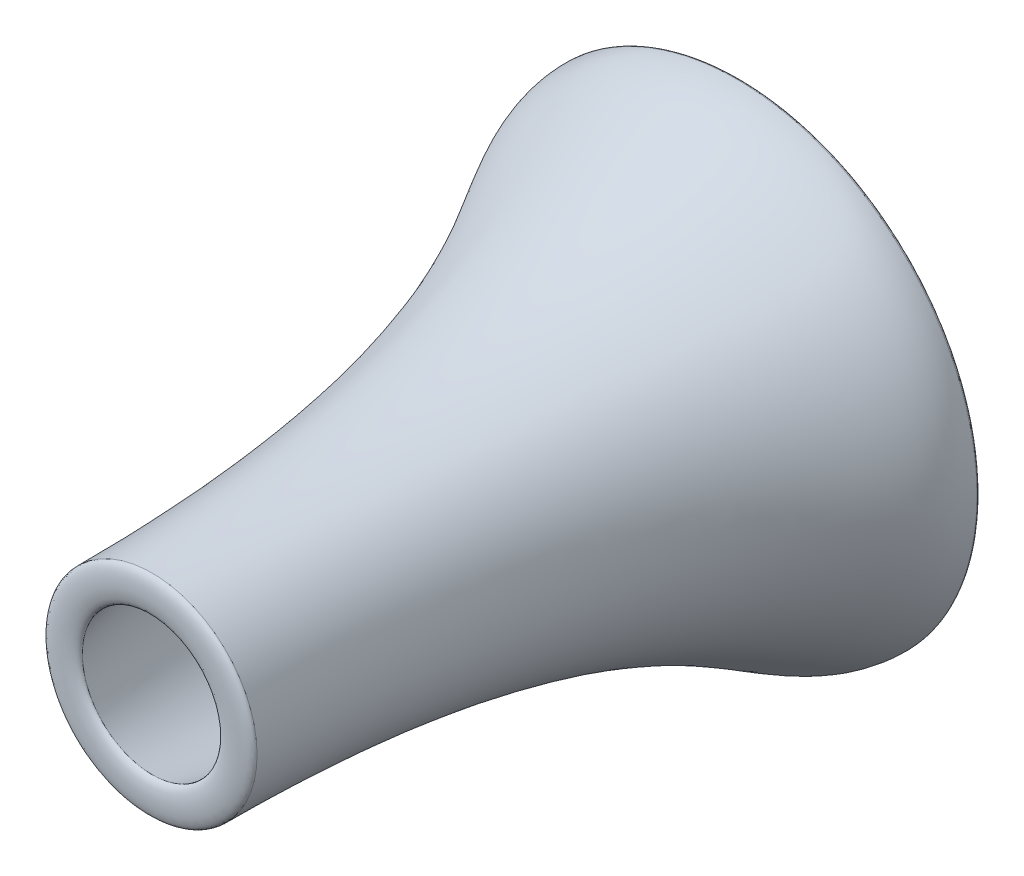
ISO-10303-21;
HEADER;
FILE_DESCRIPTION(('STEP AP214'),'2;1');
FILE_NAME('part.step','',(''),(''),'','','');
FILE_SCHEMA(('AUTOMOTIVE_DESIGN { 1 0 10303 214 1 1 1 1 }'));
ENDSEC;
DATA;
#1=APPLICATION_CONTEXT('core data for automotive mechanical design processes');
#2=APPLICATION_PROTOCOL_DEFINITION('international standard','automotive_design',2000,#1);
#3=PRODUCT_CONTEXT('',#1,'mechanical');
#4=PRODUCT('Part','Part','',(#3));
#5=PRODUCT_RELATED_PRODUCT_CATEGORY('part','',(#4));
#6=PRODUCT_DEFINITION_FORMATION('','',#4);
#7=PRODUCT_DEFINITION_CONTEXT('part definition',#1,'design');
#8=PRODUCT_DEFINITION('design','',#6,#7);
#9=PRODUCT_DEFINITION_SHAPE('','',#8);
#10=(LENGTH_UNIT() NAMED_UNIT(*) SI_UNIT(.MILLI.,.METRE.));
#11=(NAMED_UNIT(*) PLANE_ANGLE_UNIT() SI_UNIT($,.RADIAN.));
#12=(NAMED_UNIT(*) SI_UNIT($,.STERADIAN.) SOLID_ANGLE_UNIT());
#13=UNCERTAINTY_MEASURE_WITH_UNIT(LENGTH_MEASURE(1.E-05),#10,'distance_accuracy_value','');
#14=(GEOMETRIC_REPRESENTATION_CONTEXT(3) GLOBAL_UNCERTAINTY_ASSIGNED_CONTEXT((#13)) GLOBAL_UNIT_ASSIGNED_CONTEXT((#10,
#11,#12)) REPRESENTATION_CONTEXT('',''));
#15=CARTESIAN_POINT('',(0.,0.,0.));
#16=DIRECTION('',(0.,0.,1.));
#17=DIRECTION('',(1.,0.,0.));
#18=AXIS2_PLACEMENT_3D('',#15,#16,#17);
#19=CARTESIAN_POINT('',(-166.463971853403,0.,1094.65467806476));
#20=CARTESIAN_POINT('',(-166.463971853403,0.,1107.35467806476));
#21=CARTESIAN_POINT('',(-110.643738413778,0.,1107.35467806476));
#22=CARTESIAN_POINT('',(-110.643738413778,0.,1094.65467806476));
#23=B_SPLINE_CURVE_WITH_KNOTS('',3,(#19,#20,#21,#22),.UNSPECIFIED.,.F.,.F.,(4,4),(0.,1.),.UNSPECIFIED.);
#24=CARTESIAN_POINT('',(0.,0.,1104.75683012291));
#25=DIRECTION('',(0.,0.,1.));
#26=AXIS1_PLACEMENT('',#24,#25);
#27=SURFACE_OF_REVOLUTION('',#23,#26);
#28=CARTESIAN_POINT('',(0.,0.,1094.65467806476));
#29=DIRECTION('',(0.,0.,1.));
#30=DIRECTION('',(1.,0.,0.));
#31=AXIS2_PLACEMENT_3D('',#28,#29,#30);
#32=CIRCLE('',#31,110.643738413778);
#33=CARTESIAN_POINT('',(110.643738413778,0.,1094.65467806476));
#34=VERTEX_POINT('',#33);
#35=EDGE_CURVE('E47',#34,#34,#32,.T.);
#36=ORIENTED_EDGE('',*,*,#35,.F.);
#37=EDGE_LOOP('',(#36));
#38=FACE_BOUND('',#37,.T.);
#39=CARTESIAN_POINT('',(0.,0.,1094.65467806476));
#40=DIRECTION('',(0.,0.,1.));
#41=DIRECTION('',(1.,0.,0.));
#42=AXIS2_PLACEMENT_3D('',#39,#40,#41);
#43=CIRCLE('',#42,166.463971853403);
#44=CARTESIAN_POINT('',(166.463971853403,0.,1094.65467806476));
#45=VERTEX_POINT('',#44);
#46=EDGE_CURVE('E11',#45,#45,#43,.T.);
#47=ORIENTED_EDGE('',*,*,#46,.T.);
#48=EDGE_LOOP('',(#47));
#49=FACE_BOUND('',#48,.T.);
#50=ADVANCED_FACE('F40',(#38,#49),#27,.T.);
#51=CARTESIAN_POINT('',(-166.463971853403,0.,1094.65467806476));
#52=DIRECTION('',(0.,0.,1.));
#53=DIRECTION('',(1.,0.,0.));
#54=AXIS2_PLACEMENT_3D('',#51,#52,#53);
#55=PLANE('',#54);
#56=ORIENTED_EDGE('',*,*,#46,.F.);
#57=EDGE_LOOP('',(#56));
#58=FACE_BOUND('',#57,.T.);
#59=ORIENTED_EDGE('',*,*,#35,.T.);
#60=EDGE_LOOP('',(#59));
#61=FACE_BOUND('',#60,.T.);
#62=ADVANCED_FACE('F59',(#58,#61),#55,.F.);
#63=CLOSED_SHELL('',(#50,#62));
#64=MANIFOLD_SOLID_BREP('B2',#63);
#65=CARTESIAN_POINT('',(-259.495458194181,0.,167.561077713543));
#66=CARTESIAN_POINT('',(-259.495458194181,0.,150.62774438021));
#67=CARTESIAN_POINT('',(-381.249942517428,0.,150.62774438021));
#68=CARTESIAN_POINT('',(-381.249942517428,0.,167.561077713543));
#69=B_SPLINE_CURVE_WITH_KNOTS('',3,(#65,#66,#67,#68),.UNSPECIFIED.,.F.,.F.,(4,4),(0.,1.),.UNSPECIFIED.);
#70=CARTESIAN_POINT('',(0.,0.,99.6847843209707));
#71=DIRECTION('',(0.,0.,1.));
#72=AXIS1_PLACEMENT('',#70,#71);
#73=SURFACE_OF_REVOLUTION('',#69,#72);
#74=CARTESIAN_POINT('',(0.,0.,167.561077713543));
#75=DIRECTION('',(0.,0.,1.));
#76=DIRECTION('',(1.,0.,0.));
#77=AXIS2_PLACEMENT_3D('',#74,#75,#76);
#78=CIRCLE('',#77,381.249942517428);
#79=CARTESIAN_POINT('',(381.249942517428,0.,167.561077713543));
#80=VERTEX_POINT('',#79);
#81=EDGE_CURVE('E39',#80,#80,#78,.T.);
#82=ORIENTED_EDGE('',*,*,#81,.F.);
#83=EDGE_LOOP('',(#82));
#84=FACE_BOUND('',#83,.T.);
#85=CARTESIAN_POINT('',(0.,0.,167.561077713543));
#86=DIRECTION('',(0.,0.,1.));
#87=DIRECTION('',(1.,0.,0.));
#88=AXIS2_PLACEMENT_3D('',#85,#86,#87);
#89=CIRCLE('',#88,259.495458194181);
#90=CARTESIAN_POINT('',(259.495458194181,0.,167.561077713543));
#91=VERTEX_POINT('',#90);
#92=EDGE_CURVE('E93',#91,#91,#89,.T.);
#93=ORIENTED_EDGE('',*,*,#92,.T.);
#94=EDGE_LOOP('',(#93));
#95=FACE_BOUND('',#94,.T.);
#96=ADVANCED_FACE('F86',(#84,#95),#73,.T.);
#97=CARTESIAN_POINT('',(-381.249942517428,0.,167.561077713543));
#98=DIRECTION('',(0.,0.,-1.));
#99=DIRECTION('',(-1.,0.,0.));
#100=AXIS2_PLACEMENT_3D('',#97,#98,#99);
#101=PLANE('',#100);
#102=ORIENTED_EDGE('',*,*,#92,.F.);
#103=EDGE_LOOP('',(#102));
#104=FACE_BOUND('',#103,.T.);
#105=ORIENTED_EDGE('',*,*,#81,.T.);
#106=EDGE_LOOP('',(#105));
#107=FACE_BOUND('',#106,.T.);
#108=ADVANCED_FACE('F106',(#104,#107),#101,.F.);
#109=CLOSED_SHELL('',(#96,#108));
#110=MANIFOLD_SOLID_BREP('B6',#109);
#111=CARTESIAN_POINT('',(-110.643738413778,0.,1094.65467806476));
#112=CARTESIAN_POINT('',(-183.485035369402,0.,717.331180746709));
#113=CARTESIAN_POINT('',(-128.674034213742,0.,903.320051910767));
#114=CARTESIAN_POINT('',(-243.481208411908,0.,195.194577557418));
#115=CARTESIAN_POINT('',(-259.495458194181,0.,167.561077713543));
#116=B_SPLINE_CURVE_WITH_KNOTS('',3,(#111,#112,#113,#114,#115),.UNSPECIFIED.,.F.,.F.,(4,1,4),
(0.,0.793493092504956,1.),.UNSPECIFIED.);
#117=CARTESIAN_POINT('',(0.,0.,99.6847843209707));
#118=DIRECTION('',(0.,0.,1.));
#119=AXIS1_PLACEMENT('',#117,#118);
#120=SURFACE_OF_REVOLUTION('',#116,#119);
#121=CARTESIAN_POINT('',(0.,0.,167.561077713543));
#122=DIRECTION('',(0.,0.,1.));
#123=DIRECTION('',(1.,0.,0.));
#124=AXIS2_PLACEMENT_3D('',#121,#122,#123);
#125=CIRCLE('',#124,259.495458194181);
#126=CARTESIAN_POINT('',(259.495458194181,0.,167.561077713543));
#127=VERTEX_POINT('',#126);
#128=EDGE_CURVE('E85',#127,#127,#125,.T.);
#129=ORIENTED_EDGE('',*,*,#128,.F.);
#130=EDGE_LOOP('',(#129));
#131=FACE_BOUND('',#130,.T.);
#132=CARTESIAN_POINT('',(0.,0.,1094.65467806476));
#133=DIRECTION('',(0.,0.,1.));
#134=DIRECTION('',(1.,0.,0.));
#135=AXIS2_PLACEMENT_3D('',#132,#133,#134);
#136=CIRCLE('',#135,110.643738413778);
#137=CARTESIAN_POINT('',(110.643738413778,0.,1094.65467806476));
#138=VERTEX_POINT('',#137);
#139=EDGE_CURVE('E140',#138,#138,#136,.T.);
#140=ORIENTED_EDGE('',*,*,#139,.T.);
#141=EDGE_LOOP('',(#140));
#142=FACE_BOUND('',#141,.T.);
#143=ADVANCED_FACE('F125',(#131,#142),#120,.T.);
#144=CARTESIAN_POINT('',(-259.495458194181,0.,167.561077713543));
#145=DIRECTION('',(0.,0.,1.));
#146=DIRECTION('',(1.,0.,0.));
#147=AXIS2_PLACEMENT_3D('',#144,#145,#146);
#148=PLANE('',#147);
#149=CARTESIAN_POINT('',(0.,0.,167.561077713543));
#150=DIRECTION('',(0.,0.,1.));
#151=DIRECTION('',(1.,0.,0.));
#152=AXIS2_PLACEMENT_3D('',#149,#150,#151);
#153=CIRCLE('',#152,381.249942517428);
#154=CARTESIAN_POINT('',(381.249942517428,0.,167.561077713543));
#155=VERTEX_POINT('',#154);
#156=EDGE_CURVE('E132',#155,#155,#153,.T.);
#157=ORIENTED_EDGE('',*,*,#156,.F.);
#158=EDGE_LOOP('',(#157));
#159=FACE_BOUND('',#158,.T.);
#160=ORIENTED_EDGE('',*,*,#128,.T.);
#161=EDGE_LOOP('',(#160));
#162=FACE_BOUND('',#161,.T.);
#163=ADVANCED_FACE('F159',(#159,#162),#148,.F.);
#164=CARTESIAN_POINT('',(-381.249942517428,0.,167.561077713543));
#165=CARTESIAN_POINT('',(-381.249942517428,0.,292.945030089835));
#166=CARTESIAN_POINT('',(-166.463971853403,0.,364.345557679519));
#167=CARTESIAN_POINT('',(-166.463971853403,0.,1094.65467806476));
#168=B_SPLINE_CURVE_WITH_KNOTS('',3,(#164,#165,#166,#167),.UNSPECIFIED.,.F.,.F.,(4,4),(0.,1.),.UNSPECIFIED.);
#169=CARTESIAN_POINT('',(0.,0.,99.6847843209707));
#170=DIRECTION('',(0.,0.,1.));
#171=AXIS1_PLACEMENT('',#169,#170);
#172=SURFACE_OF_REVOLUTION('',#168,#171);
#173=CARTESIAN_POINT('',(0.,0.,1094.65467806476));
#174=DIRECTION('',(0.,0.,1.));
#175=DIRECTION('',(1.,0.,0.));
#176=AXIS2_PLACEMENT_3D('',#173,#174,#175);
#177=CIRCLE('',#176,166.463971853403);
#178=CARTESIAN_POINT('',(166.463971853403,0.,1094.65467806476));
#179=VERTEX_POINT('',#178);
#180=EDGE_CURVE('E136',#179,#179,#177,.T.);
#181=ORIENTED_EDGE('',*,*,#180,.F.);
#182=EDGE_LOOP('',(#181));
#183=FACE_BOUND('',#182,.T.);
#184=ORIENTED_EDGE('',*,*,#156,.T.);
#185=EDGE_LOOP('',(#184));
#186=FACE_BOUND('',#185,.T.);
#187=ADVANCED_FACE('F155',(#183,#186),#172,.T.);
#188=CARTESIAN_POINT('',(-110.643738413778,0.,1094.65467806476));
#189=DIRECTION('',(0.,0.,-1.));
#190=DIRECTION('',(-1.,0.,0.));
#191=AXIS2_PLACEMENT_3D('',#188,#189,#190);
#192=PLANE('',#191);
#193=ORIENTED_EDGE('',*,*,#139,.F.);
#194=EDGE_LOOP('',(#193));
#195=FACE_BOUND('',#194,.T.);
#196=ORIENTED_EDGE('',*,*,#180,.T.);
#197=EDGE_LOOP('',(#196));
#198=FACE_BOUND('',#197,.T.);
#199=ADVANCED_FACE('F158',(#195,#198),#192,.F.);
#200=CLOSED_SHELL('',(#143,#163,#187,#199));
#201=MANIFOLD_SOLID_BREP('B34',#200);
#202=ADVANCED_BREP_SHAPE_REPRESENTATION('',(#18,#64,#110,#201),#14);
#203=SHAPE_DEFINITION_REPRESENTATION(#9,#202);
ENDSEC;
END-ISO-10303-21;
